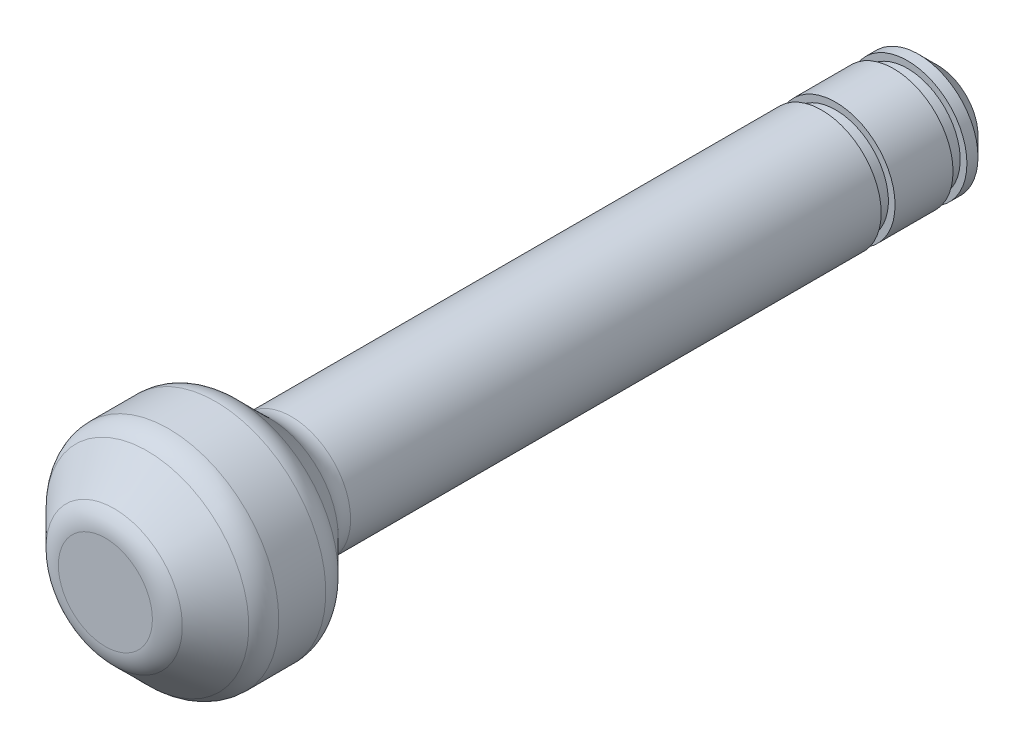
ISO-10303-21;
HEADER;
FILE_DESCRIPTION(('STEP AP214'),'2;1');
FILE_NAME('part.step','',(''),(''),'','','');
FILE_SCHEMA(('AUTOMOTIVE_DESIGN { 1 0 10303 214 1 1 1 1 }'));
ENDSEC;
DATA;
#1=APPLICATION_CONTEXT('core data for automotive mechanical design processes');
#2=APPLICATION_PROTOCOL_DEFINITION('international standard','automotive_design',2000,#1);
#3=PRODUCT_CONTEXT('',#1,'mechanical');
#4=PRODUCT('Part','Part','',(#3));
#5=PRODUCT_RELATED_PRODUCT_CATEGORY('part','',(#4));
#6=PRODUCT_DEFINITION_FORMATION('','',#4);
#7=PRODUCT_DEFINITION_CONTEXT('part definition',#1,'design');
#8=PRODUCT_DEFINITION('design','',#6,#7);
#9=PRODUCT_DEFINITION_SHAPE('','',#8);
#10=(LENGTH_UNIT() NAMED_UNIT(*) SI_UNIT(.MILLI.,.METRE.));
#11=(NAMED_UNIT(*) PLANE_ANGLE_UNIT() SI_UNIT($,.RADIAN.));
#12=(NAMED_UNIT(*) SI_UNIT($,.STERADIAN.) SOLID_ANGLE_UNIT());
#13=UNCERTAINTY_MEASURE_WITH_UNIT(LENGTH_MEASURE(1.E-05),#10,'distance_accuracy_value','');
#14=(GEOMETRIC_REPRESENTATION_CONTEXT(3) GLOBAL_UNCERTAINTY_ASSIGNED_CONTEXT((#13)) GLOBAL_UNIT_ASSIGNED_CONTEXT((#10,
#11,#12)) REPRESENTATION_CONTEXT('',''));
#15=CARTESIAN_POINT('',(0.,0.,0.));
#16=DIRECTION('',(0.,0.,1.));
#17=DIRECTION('',(1.,0.,0.));
#18=AXIS2_PLACEMENT_3D('',#15,#16,#17);
#19=CARTESIAN_POINT('',(0.,3.1496,-39.5224));
#20=DIRECTION('',(0.,0.,1.));
#21=DIRECTION('',(1.,0.,0.));
#22=AXIS2_PLACEMENT_3D('',#19,#20,#21);
#23=PLANE('',#22);
#24=CARTESIAN_POINT('',(0.,0.,-39.522399999953));
#25=DIRECTION('',(0.,0.,1.));
#26=DIRECTION('',(1.,0.,0.));
#27=AXIS2_PLACEMENT_3D('',#24,#25,#26);
#28=CIRCLE('',#27,2.14959999988196);
#29=CARTESIAN_POINT('',(2.14959999988196,0.,-39.522399999953));
#30=VERTEX_POINT('',#29);
#31=EDGE_CURVE('E48',#30,#30,#28,.T.);
#32=ORIENTED_EDGE('',*,*,#31,.F.);
#33=EDGE_LOOP('',(#32));
#34=FACE_BOUND('',#33,.T.);
#35=ADVANCED_FACE('F16',(#34),#23,.F.);
#36=CARTESIAN_POINT('',(0.,0.,-38.5223999999766));
#37=DIRECTION('',(0.,0.,1.));
#38=DIRECTION('',(1.,0.,0.));
#39=AXIS2_PLACEMENT_3D('',#36,#37,#38);
#40=CONICAL_SURFACE('',#39,3.14959999985831,0.785398163397448);
#41=ORIENTED_EDGE('',*,*,#31,.T.);
#42=EDGE_LOOP('',(#41));
#43=FACE_BOUND('',#42,.T.);
#44=CARTESIAN_POINT('',(0.,0.,-38.5224));
#45=DIRECTION('',(0.,0.,1.));
#46=DIRECTION('',(1.,0.,0.));
#47=AXIS2_PLACEMENT_3D('',#44,#45,#46);
#48=CIRCLE('',#47,3.1496);
#49=CARTESIAN_POINT('',(3.1496,0.,-38.5224));
#50=VERTEX_POINT('',#49);
#51=EDGE_CURVE('E46',#50,#50,#48,.T.);
#52=ORIENTED_EDGE('',*,*,#51,.F.);
#53=EDGE_LOOP('',(#52));
#54=FACE_BOUND('',#53,.T.);
#55=ADVANCED_FACE('F237',(#43,#54),#40,.T.);
#56=CARTESIAN_POINT('',(0.,0.,60.9008204406939));
#57=DIRECTION('',(0.,0.,1.));
#58=DIRECTION('',(1.,0.,0.));
#59=AXIS2_PLACEMENT_3D('',#56,#57,#58);
#60=CYLINDRICAL_SURFACE('',#59,3.1496);
#61=ORIENTED_EDGE('',*,*,#51,.T.);
#62=EDGE_LOOP('',(#61));
#63=FACE_BOUND('',#62,.T.);
#64=CARTESIAN_POINT('',(0.,0.,-37.9349));
#65=DIRECTION('',(0.,0.,1.));
#66=DIRECTION('',(1.,0.,0.));
#67=AXIS2_PLACEMENT_3D('',#64,#65,#66);
#68=CIRCLE('',#67,3.1496);
#69=CARTESIAN_POINT('',(3.1496,0.,-37.9349));
#70=VERTEX_POINT('',#69);
#71=EDGE_CURVE('E42',#70,#70,#68,.F.);
#72=ORIENTED_EDGE('',*,*,#71,.T.);
#73=EDGE_LOOP('',(#72));
#74=FACE_BOUND('',#73,.T.);
#75=ADVANCED_FACE('F229',(#63,#74),#60,.T.);
#76=CARTESIAN_POINT('',(0.,3.1496,4.59740000000003));
#77=DIRECTION('',(0.,0.,-1.));
#78=DIRECTION('',(-1.,0.,0.));
#79=AXIS2_PLACEMENT_3D('',#76,#77,#78);
#80=PLANE('',#79);
#81=CARTESIAN_POINT('',(0.,0.,4.59740000000003));
#82=DIRECTION('',(0.,0.,-1.));
#83=DIRECTION('',(-1.,0.,0.));
#84=AXIS2_PLACEMENT_3D('',#81,#82,#83);
#85=CIRCLE('',#84,2.4920359697327);
#86=CARTESIAN_POINT('',(-2.4920359697327,0.,4.59740000000003));
#87=VERTEX_POINT('',#86);
#88=CARTESIAN_POINT('',(2.4920359697327,0.,4.59740000000003));
#89=VERTEX_POINT('',#88);
#90=EDGE_CURVE('E36',#87,#89,#85,.T.);
#91=ORIENTED_EDGE('',*,*,#90,.F.);
#92=CARTESIAN_POINT('',(0.,0.,4.59740000000003));
#93=DIRECTION('',(0.,0.,-1.));
#94=DIRECTION('',(1.,0.,0.));
#95=AXIS2_PLACEMENT_3D('',#92,#93,#94);
#96=CIRCLE('',#95,2.4920359697327);
#97=EDGE_CURVE('E33',#89,#87,#96,.T.);
#98=ORIENTED_EDGE('',*,*,#97,.F.);
#99=EDGE_LOOP('',(#91,#98));
#100=FACE_BOUND('',#99,.T.);
#101=ADVANCED_FACE('F38',(#100),#80,.F.);
#102=CARTESIAN_POINT('',(0.,2.794,-37.9349));
#103=DIRECTION('',(0.,0.,-1.));
#104=DIRECTION('',(-1.,0.,0.));
#105=AXIS2_PLACEMENT_3D('',#102,#103,#104);
#106=PLANE('',#105);
#107=CARTESIAN_POINT('',(0.,0.,-37.9349));
#108=DIRECTION('',(0.,0.,-1.));
#109=DIRECTION('',(-1.,0.,0.));
#110=AXIS2_PLACEMENT_3D('',#107,#108,#109);
#111=CIRCLE('',#110,2.794);
#112=CARTESIAN_POINT('',(-2.794,0.,-37.9349));
#113=VERTEX_POINT('',#112);
#114=EDGE_CURVE('E41',#113,#113,#111,.F.);
#115=ORIENTED_EDGE('',*,*,#114,.F.);
#116=EDGE_LOOP('',(#115));
#117=FACE_BOUND('',#116,.T.);
#118=ORIENTED_EDGE('',*,*,#71,.F.);
#119=EDGE_LOOP('',(#118));
#120=FACE_BOUND('',#119,.T.);
#121=ADVANCED_FACE('F93',(#117,#120),#106,.F.);
#122=CARTESIAN_POINT('',(0.,0.,3.00990000000003));
#123=DIRECTION('',(0.,0.,-1.));
#124=DIRECTION('',(-1.,0.,0.));
#125=AXIS2_PLACEMENT_3D('',#122,#123,#124);
#126=TOROIDAL_SURFACE('',#125,2.4920359697327,1.5875);
#127=CARTESIAN_POINT('',(0.,0.,4.13243201518299));
#128=DIRECTION('',(0.,0.,-1.));
#129=DIRECTION('',(-1.,0.,0.));
#130=AXIS2_PLACEMENT_3D('',#127,#128,#129);
#131=CIRCLE('',#130,3.6145679848687);
#132=CARTESIAN_POINT('',(-3.6145679848687,0.,4.13243201518299));
#133=VERTEX_POINT('',#132);
#134=EDGE_CURVE('E55',#133,#133,#131,.T.);
#135=ORIENTED_EDGE('',*,*,#134,.F.);
#136=EDGE_LOOP('',(#135));
#137=FACE_BOUND('',#136,.T.);
#138=ORIENTED_EDGE('',*,*,#90,.T.);
#139=ORIENTED_EDGE('',*,*,#97,.T.);
#140=EDGE_LOOP('',(#138,#139));
#141=FACE_BOUND('',#140,.T.);
#142=ADVANCED_FACE('F45',(#137,#141),#126,.T.);
#143=CARTESIAN_POINT('',(0.,0.,-40.0654390361338));
#144=DIRECTION('',(0.,0.,-1.));
#145=DIRECTION('',(-1.,0.,0.));
#146=AXIS2_PLACEMENT_3D('',#143,#144,#145);
#147=CYLINDRICAL_SURFACE('',#146,2.794);
#148=ORIENTED_EDGE('',*,*,#114,.T.);
#149=EDGE_LOOP('',(#148));
#150=FACE_BOUND('',#149,.T.);
#151=CARTESIAN_POINT('',(0.,0.,-37.1983));
#152=DIRECTION('',(0.,0.,-1.));
#153=DIRECTION('',(-1.,0.,0.));
#154=AXIS2_PLACEMENT_3D('',#151,#152,#153);
#155=CIRCLE('',#154,2.794);
#156=CARTESIAN_POINT('',(-2.794,0.,-37.1983));
#157=VERTEX_POINT('',#156);
#158=EDGE_CURVE('E56',#157,#157,#155,.T.);
#159=ORIENTED_EDGE('',*,*,#158,.T.);
#160=EDGE_LOOP('',(#159));
#161=FACE_BOUND('',#160,.T.);
#162=ADVANCED_FACE('F92',(#150,#161),#147,.T.);
#163=CARTESIAN_POINT('',(0.,0.,2.36996798491873));
#164=DIRECTION('',(0.,0.,-1.));
#165=DIRECTION('',(-1.,0.,0.));
#166=AXIS2_PLACEMENT_3D('',#163,#164,#165);
#167=CONICAL_SURFACE('',#166,5.37703201513295,0.785398163381322);
#168=CARTESIAN_POINT('',(0.,0.,2.36996798486636));
#169=DIRECTION('',(0.,0.,-1.));
#170=DIRECTION('',(-1.,0.,0.));
#171=AXIS2_PLACEMENT_3D('',#168,#169,#170);
#172=CIRCLE('',#171,5.37703201513365);
#173=CARTESIAN_POINT('',(-5.37703201513365,0.,2.36996798486636));
#174=VERTEX_POINT('',#173);
#175=EDGE_CURVE('E59',#174,#174,#172,.T.);
#176=ORIENTED_EDGE('',*,*,#175,.F.);
#177=EDGE_LOOP('',(#176));
#178=FACE_BOUND('',#177,.T.);
#179=ORIENTED_EDGE('',*,*,#134,.T.);
#180=EDGE_LOOP('',(#179));
#181=FACE_BOUND('',#180,.T.);
#182=ADVANCED_FACE('F117',(#178,#181),#167,.T.);
#183=CARTESIAN_POINT('',(0.,2.794,-37.1983));
#184=DIRECTION('',(0.,0.,1.));
#185=DIRECTION('',(1.,0.,0.));
#186=AXIS2_PLACEMENT_3D('',#183,#184,#185);
#187=PLANE('',#186);
#188=CARTESIAN_POINT('',(0.,0.,-37.1983));
#189=DIRECTION('',(0.,0.,1.));
#190=DIRECTION('',(1.,0.,0.));
#191=AXIS2_PLACEMENT_3D('',#188,#189,#190);
#192=CIRCLE('',#191,3.1496);
#193=CARTESIAN_POINT('',(3.1496,0.,-37.1983));
#194=VERTEX_POINT('',#193);
#195=EDGE_CURVE('E60',#194,#194,#192,.T.);
#196=ORIENTED_EDGE('',*,*,#195,.F.);
#197=EDGE_LOOP('',(#196));
#198=FACE_BOUND('',#197,.T.);
#199=ORIENTED_EDGE('',*,*,#158,.F.);
#200=EDGE_LOOP('',(#199));
#201=FACE_BOUND('',#200,.T.);
#202=ADVANCED_FACE('F113',(#198,#201),#187,.F.);
#203=CARTESIAN_POINT('',(0.,0.,1.24743596973272));
#204=DIRECTION('',(0.,0.,-1.));
#205=DIRECTION('',(-1.,0.,0.));
#206=AXIS2_PLACEMENT_3D('',#203,#204,#205);
#207=TOROIDAL_SURFACE('',#206,4.2545,1.5875);
#208=CARTESIAN_POINT('',(0.,0.,1.24743596973272));
#209=DIRECTION('',(0.,0.,1.));
#210=DIRECTION('',(1.,0.,0.));
#211=AXIS2_PLACEMENT_3D('',#208,#209,#210);
#212=CIRCLE('',#211,5.842);
#213=CARTESIAN_POINT('',(5.842,0.,1.24743596973272));
#214=VERTEX_POINT('',#213);
#215=EDGE_CURVE('E63',#214,#214,#212,.F.);
#216=ORIENTED_EDGE('',*,*,#215,.F.);
#217=EDGE_LOOP('',(#216));
#218=FACE_BOUND('',#217,.T.);
#219=ORIENTED_EDGE('',*,*,#175,.T.);
#220=EDGE_LOOP('',(#219));
#221=FACE_BOUND('',#220,.T.);
#222=ADVANCED_FACE('F108',(#218,#221),#207,.T.);
#223=CARTESIAN_POINT('',(0.,0.,60.9008204406939));
#224=DIRECTION('',(0.,0.,1.));
#225=DIRECTION('',(1.,0.,0.));
#226=AXIS2_PLACEMENT_3D('',#223,#224,#225);
#227=CYLINDRICAL_SURFACE('',#226,3.1496);
#228=ORIENTED_EDGE('',*,*,#195,.T.);
#229=EDGE_LOOP('',(#228));
#230=FACE_BOUND('',#229,.T.);
#231=CARTESIAN_POINT('',(0.,0.,-34.1249));
#232=DIRECTION('',(0.,0.,1.));
#233=DIRECTION('',(1.,0.,0.));
#234=AXIS2_PLACEMENT_3D('',#231,#232,#233);
#235=CIRCLE('',#234,3.1496);
#236=CARTESIAN_POINT('',(3.1496,0.,-34.1249));
#237=VERTEX_POINT('',#236);
#238=EDGE_CURVE('E64',#237,#237,#235,.F.);
#239=ORIENTED_EDGE('',*,*,#238,.T.);
#240=EDGE_LOOP('',(#239));
#241=FACE_BOUND('',#240,.T.);
#242=ADVANCED_FACE('F112',(#230,#241),#227,.T.);
#243=CARTESIAN_POINT('',(0.,0.,60.9008204406939));
#244=DIRECTION('',(0.,0.,1.));
#245=DIRECTION('',(1.,0.,0.));
#246=AXIS2_PLACEMENT_3D('',#243,#244,#245);
#247=CYLINDRICAL_SURFACE('',#246,5.842);
#248=ORIENTED_EDGE('',*,*,#215,.T.);
#249=EDGE_LOOP('',(#248));
#250=FACE_BOUND('',#249,.T.);
#251=CARTESIAN_POINT('',(0.,0.,-1.24743596973272));
#252=DIRECTION('',(0.,0.,-1.));
#253=DIRECTION('',(-1.,0.,0.));
#254=AXIS2_PLACEMENT_3D('',#251,#252,#253);
#255=CIRCLE('',#254,5.842);
#256=CARTESIAN_POINT('',(-5.842,0.,-1.24743596973272));
#257=VERTEX_POINT('',#256);
#258=EDGE_CURVE('E67',#257,#257,#255,.T.);
#259=ORIENTED_EDGE('',*,*,#258,.F.);
#260=EDGE_LOOP('',(#259));
#261=FACE_BOUND('',#260,.T.);
#262=ADVANCED_FACE('F159',(#250,#261),#247,.T.);
#263=CARTESIAN_POINT('',(0.,3.1496,-34.1249));
#264=DIRECTION('',(0.,0.,-1.));
#265=DIRECTION('',(-1.,0.,0.));
#266=AXIS2_PLACEMENT_3D('',#263,#264,#265);
#267=PLANE('',#266);
#268=CARTESIAN_POINT('',(0.,0.,-34.1249));
#269=DIRECTION('',(0.,0.,-1.));
#270=DIRECTION('',(-1.,0.,0.));
#271=AXIS2_PLACEMENT_3D('',#268,#269,#270);
#272=CIRCLE('',#271,2.794);
#273=CARTESIAN_POINT('',(-2.794,0.,-34.1249));
#274=VERTEX_POINT('',#273);
#275=EDGE_CURVE('E68',#274,#274,#272,.F.);
#276=ORIENTED_EDGE('',*,*,#275,.F.);
#277=EDGE_LOOP('',(#276));
#278=FACE_BOUND('',#277,.T.);
#279=ORIENTED_EDGE('',*,*,#238,.F.);
#280=EDGE_LOOP('',(#279));
#281=FACE_BOUND('',#280,.T.);
#282=ADVANCED_FACE('F156',(#278,#281),#267,.F.);
#283=CARTESIAN_POINT('',(0.,0.,-1.24743596973272));
#284=DIRECTION('',(0.,0.,-1.));
#285=DIRECTION('',(-1.,0.,0.));
#286=AXIS2_PLACEMENT_3D('',#283,#284,#285);
#287=TOROIDAL_SURFACE('',#286,4.2545,1.5875);
#288=CARTESIAN_POINT('',(0.,0.,-2.36996798486189));
#289=DIRECTION('',(0.,0.,1.));
#290=DIRECTION('',(1.,0.,0.));
#291=AXIS2_PLACEMENT_3D('',#288,#289,#290);
#292=CIRCLE('',#291,5.37703201507611);
#293=CARTESIAN_POINT('',(5.37703201507611,0.,-2.36996798486189));
#294=VERTEX_POINT('',#293);
#295=EDGE_CURVE('E71',#294,#294,#292,.F.);
#296=ORIENTED_EDGE('',*,*,#295,.F.);
#297=EDGE_LOOP('',(#296));
#298=FACE_BOUND('',#297,.T.);
#299=ORIENTED_EDGE('',*,*,#258,.T.);
#300=EDGE_LOOP('',(#299));
#301=FACE_BOUND('',#300,.T.);
#302=ADVANCED_FACE('F151',(#298,#301),#287,.T.);
#303=CARTESIAN_POINT('',(0.,0.,-40.0654390361338));
#304=DIRECTION('',(0.,0.,-1.));
#305=DIRECTION('',(-1.,0.,0.));
#306=AXIS2_PLACEMENT_3D('',#303,#304,#305);
#307=CYLINDRICAL_SURFACE('',#306,2.794);
#308=ORIENTED_EDGE('',*,*,#275,.T.);
#309=EDGE_LOOP('',(#308));
#310=FACE_BOUND('',#309,.T.);
#311=CARTESIAN_POINT('',(0.,0.,-33.3883));
#312=DIRECTION('',(0.,0.,-1.));
#313=DIRECTION('',(-1.,0.,0.));
#314=AXIS2_PLACEMENT_3D('',#311,#312,#313);
#315=CIRCLE('',#314,2.794);
#316=CARTESIAN_POINT('',(-2.794,0.,-33.3883));
#317=VERTEX_POINT('',#316);
#318=EDGE_CURVE('E72',#317,#317,#315,.T.);
#319=ORIENTED_EDGE('',*,*,#318,.T.);
#320=EDGE_LOOP('',(#319));
#321=FACE_BOUND('',#320,.T.);
#322=ADVANCED_FACE('F155',(#310,#321),#307,.T.);
#323=CARTESIAN_POINT('',(0.,0.,-2.36996798486189));
#324=DIRECTION('',(0.,0.,1.));
#325=DIRECTION('',(1.,0.,0.));
#326=AXIS2_PLACEMENT_3D('',#323,#324,#325);
#327=CONICAL_SURFACE('',#326,5.37703201507611,0.785398163397448);
#328=ORIENTED_EDGE('',*,*,#295,.T.);
#329=EDGE_LOOP('',(#328));
#330=FACE_BOUND('',#329,.T.);
#331=CARTESIAN_POINT('',(0.,0.,-4.13243201513368));
#332=DIRECTION('',(0.,0.,1.));
#333=DIRECTION('',(1.,0.,0.));
#334=AXIS2_PLACEMENT_3D('',#331,#332,#333);
#335=CIRCLE('',#334,3.61456798486635);
#336=CARTESIAN_POINT('',(3.61456798486635,0.,-4.13243201513368));
#337=VERTEX_POINT('',#336);
#338=EDGE_CURVE('E75',#337,#337,#335,.T.);
#339=ORIENTED_EDGE('',*,*,#338,.T.);
#340=EDGE_LOOP('',(#339));
#341=FACE_BOUND('',#340,.T.);
#342=ADVANCED_FACE('F312',(#330,#341),#327,.T.);
#343=CARTESIAN_POINT('',(0.,3.1496,-33.3883));
#344=DIRECTION('',(0.,0.,1.));
#345=DIRECTION('',(1.,0.,0.));
#346=AXIS2_PLACEMENT_3D('',#343,#344,#345);
#347=PLANE('',#346);
#348=CARTESIAN_POINT('',(0.,0.,-33.3883));
#349=DIRECTION('',(0.,0.,1.));
#350=DIRECTION('',(1.,0.,0.));
#351=AXIS2_PLACEMENT_3D('',#348,#349,#350);
#352=CIRCLE('',#351,3.1496);
#353=CARTESIAN_POINT('',(3.1496,0.,-33.3883));
#354=VERTEX_POINT('',#353);
#355=EDGE_CURVE('E26',#354,#354,#352,.T.);
#356=ORIENTED_EDGE('',*,*,#355,.F.);
#357=EDGE_LOOP('',(#356));
#358=FACE_BOUND('',#357,.T.);
#359=ORIENTED_EDGE('',*,*,#318,.F.);
#360=EDGE_LOOP('',(#359));
#361=FACE_BOUND('',#360,.T.);
#362=ADVANCED_FACE('F136',(#358,#361),#347,.F.);
#363=CARTESIAN_POINT('',(0.,0.,-5.25496403026732));
#364=DIRECTION('',(0.,0.,1.));
#365=DIRECTION('',(1.,0.,0.));
#366=AXIS2_PLACEMENT_3D('',#363,#364,#365);
#367=TOROIDAL_SURFACE('',#366,4.7371,1.5875);
#368=ORIENTED_EDGE('',*,*,#338,.F.);
#369=EDGE_LOOP('',(#368));
#370=FACE_BOUND('',#369,.T.);
#371=CARTESIAN_POINT('',(0.,0.,-5.25496403026732));
#372=DIRECTION('',(0.,0.,1.));
#373=DIRECTION('',(1.,0.,0.));
#374=AXIS2_PLACEMENT_3D('',#371,#372,#373);
#375=CIRCLE('',#374,3.1496);
#376=CARTESIAN_POINT('',(3.1496,0.,-5.25496403026732));
#377=VERTEX_POINT('',#376);
#378=EDGE_CURVE('E11',#377,#377,#375,.F.);
#379=ORIENTED_EDGE('',*,*,#378,.F.);
#380=EDGE_LOOP('',(#379));
#381=FACE_BOUND('',#380,.T.);
#382=ADVANCED_FACE('F130',(#370,#381),#367,.F.);
#383=CARTESIAN_POINT('',(0.,0.,60.9008204406939));
#384=DIRECTION('',(0.,0.,1.));
#385=DIRECTION('',(1.,0.,0.));
#386=AXIS2_PLACEMENT_3D('',#383,#384,#385);
#387=CYLINDRICAL_SURFACE('',#386,3.1496);
#388=ORIENTED_EDGE('',*,*,#378,.T.);
#389=EDGE_LOOP('',(#388));
#390=FACE_BOUND('',#389,.T.);
#391=ORIENTED_EDGE('',*,*,#355,.T.);
#392=EDGE_LOOP('',(#391));
#393=FACE_BOUND('',#392,.T.);
#394=ADVANCED_FACE('F128',(#390,#393),#387,.T.);
#395=CLOSED_SHELL('',(#35,#55,#75,#101,#121,#142,#162,#182,#202,#222,#242,#262,#282,#302,#322,
#342,#362,#382,#394));
#396=MANIFOLD_SOLID_BREP('B1',#395);
#397=ADVANCED_BREP_SHAPE_REPRESENTATION('',(#18,#396),#14);
#398=SHAPE_DEFINITION_REPRESENTATION(#9,#397);
ENDSEC;
END-ISO-10303-21;
